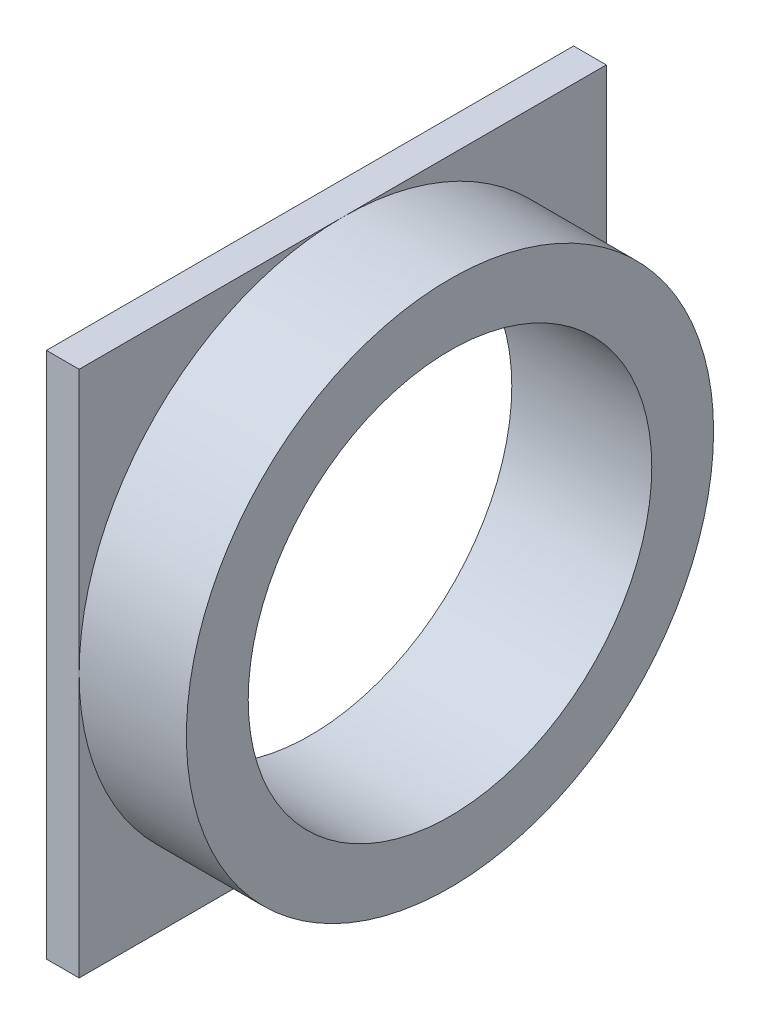
ISO-10303-21;
HEADER;
FILE_DESCRIPTION(('STEP AP214'),'2;1');
FILE_NAME('part.step','',(''),(''),'','','');
FILE_SCHEMA(('AUTOMOTIVE_DESIGN { 1 0 10303 214 1 1 1 1 }'));
ENDSEC;
DATA;
#1=APPLICATION_CONTEXT('core data for automotive mechanical design processes');
#2=APPLICATION_PROTOCOL_DEFINITION('international standard','automotive_design',2000,#1);
#3=PRODUCT_CONTEXT('',#1,'mechanical');
#4=PRODUCT('Part','Part','',(#3));
#5=PRODUCT_RELATED_PRODUCT_CATEGORY('part','',(#4));
#6=PRODUCT_DEFINITION_FORMATION('','',#4);
#7=PRODUCT_DEFINITION_CONTEXT('part definition',#1,'design');
#8=PRODUCT_DEFINITION('design','',#6,#7);
#9=PRODUCT_DEFINITION_SHAPE('','',#8);
#10=(LENGTH_UNIT() NAMED_UNIT(*) SI_UNIT(.MILLI.,.METRE.));
#11=(NAMED_UNIT(*) PLANE_ANGLE_UNIT() SI_UNIT($,.RADIAN.));
#12=(NAMED_UNIT(*) SI_UNIT($,.STERADIAN.) SOLID_ANGLE_UNIT());
#13=UNCERTAINTY_MEASURE_WITH_UNIT(LENGTH_MEASURE(1.E-05),#10,'distance_accuracy_value','');
#14=(GEOMETRIC_REPRESENTATION_CONTEXT(3) GLOBAL_UNCERTAINTY_ASSIGNED_CONTEXT((#13)) GLOBAL_UNIT_ASSIGNED_CONTEXT((#10,
#11,#12)) REPRESENTATION_CONTEXT('',''));
#15=CARTESIAN_POINT('',(0.,0.,0.));
#16=DIRECTION('',(0.,0.,1.));
#17=DIRECTION('',(1.,0.,0.));
#18=AXIS2_PLACEMENT_3D('',#15,#16,#17);
#19=CARTESIAN_POINT('',(7.7,0.,0.));
#20=DIRECTION('',(-1.,0.,0.));
#21=DIRECTION('',(0.,0.,1.));
#22=AXIS2_PLACEMENT_3D('',#19,#20,#21);
#23=CYLINDRICAL_SURFACE('',#22,14.5);
#24=CARTESIAN_POINT('',(7.7,0.,0.));
#25=DIRECTION('',(1.,0.,0.));
#26=DIRECTION('',(0.,0.,-1.));
#27=AXIS2_PLACEMENT_3D('',#24,#25,#26);
#28=CIRCLE('',#27,14.5);
#29=CARTESIAN_POINT('',(7.7,0.,-14.5));
#30=VERTEX_POINT('',#29);
#31=EDGE_CURVE('E113',#30,#30,#28,.T.);
#32=ORIENTED_EDGE('',*,*,#31,.F.);
#33=EDGE_LOOP('',(#32));
#34=FACE_BOUND('',#33,.T.);
#35=CARTESIAN_POINT('',(1.8,0.,0.));
#36=DIRECTION('',(-1.,0.,0.));
#37=DIRECTION('',(0.,0.,1.));
#38=AXIS2_PLACEMENT_3D('',#35,#36,#37);
#39=CIRCLE('',#38,14.5);
#40=CARTESIAN_POINT('',(1.8,0.,14.5));
#41=VERTEX_POINT('',#40);
#42=CARTESIAN_POINT('',(1.8,14.5,0.));
#43=VERTEX_POINT('',#42);
#44=EDGE_CURVE('E11',#41,#43,#39,.T.);
#45=ORIENTED_EDGE('',*,*,#44,.F.);
#46=CARTESIAN_POINT('',(1.8,-14.5,0.));
#47=VERTEX_POINT('',#46);
#48=EDGE_CURVE('E20',#47,#41,#39,.T.);
#49=ORIENTED_EDGE('',*,*,#48,.F.);
#50=CARTESIAN_POINT('',(1.8,0.,-14.5));
#51=VERTEX_POINT('',#50);
#52=EDGE_CURVE('E35',#51,#47,#39,.T.);
#53=ORIENTED_EDGE('',*,*,#52,.F.);
#54=EDGE_CURVE('E25',#43,#51,#39,.T.);
#55=ORIENTED_EDGE('',*,*,#54,.F.);
#56=EDGE_LOOP('',(#45,#49,#53,#55));
#57=FACE_BOUND('',#56,.T.);
#58=ADVANCED_FACE('F17',(#34,#57),#23,.T.);
#59=CARTESIAN_POINT('',(7.7,0.,0.));
#60=DIRECTION('',(1.,0.,0.));
#61=DIRECTION('',(0.,0.,-1.));
#62=AXIS2_PLACEMENT_3D('',#59,#60,#61);
#63=PLANE('',#62);
#64=CARTESIAN_POINT('',(7.7,0.,0.));
#65=DIRECTION('',(1.,0.,0.));
#66=DIRECTION('',(0.,0.,-1.));
#67=AXIS2_PLACEMENT_3D('',#64,#65,#66);
#68=CIRCLE('',#67,11.1);
#69=CARTESIAN_POINT('',(7.7,0.,-11.1));
#70=VERTEX_POINT('',#69);
#71=EDGE_CURVE('E174',#70,#70,#68,.T.);
#72=ORIENTED_EDGE('',*,*,#71,.F.);
#73=EDGE_LOOP('',(#72));
#74=FACE_BOUND('',#73,.T.);
#75=ORIENTED_EDGE('',*,*,#31,.T.);
#76=EDGE_LOOP('',(#75));
#77=FACE_BOUND('',#76,.T.);
#78=ADVANCED_FACE('F138',(#74,#77),#63,.T.);
#79=CARTESIAN_POINT('',(1.8,-14.5,-14.5));
#80=DIRECTION('',(-1.,0.,0.));
#81=DIRECTION('',(0.,0.,1.));
#82=AXIS2_PLACEMENT_3D('',#79,#80,#81);
#83=PLANE('',#82);
#84=DIRECTION('',(0.,1.,0.));
#85=VECTOR('',#84,1.);
#86=CARTESIAN_POINT('',(1.8,14.5,14.5));
#87=LINE('',#86,#85);
#88=CARTESIAN_POINT('',(1.8,14.5,14.5));
#89=VERTEX_POINT('',#88);
#90=EDGE_CURVE('E104',#41,#89,#87,.T.);
#91=ORIENTED_EDGE('',*,*,#90,.F.);
#92=ORIENTED_EDGE('',*,*,#44,.T.);
#93=DIRECTION('',(0.,0.,-1.));
#94=VECTOR('',#93,1.);
#95=CARTESIAN_POINT('',(1.8,14.5,-14.5));
#96=LINE('',#95,#94);
#97=EDGE_CURVE('E89',#89,#43,#96,.T.);
#98=ORIENTED_EDGE('',*,*,#97,.F.);
#99=EDGE_LOOP('',(#91,#92,#98));
#100=FACE_BOUND('',#99,.T.);
#101=ADVANCED_FACE('F136',(#100),#83,.F.);
#102=CARTESIAN_POINT('',(1.8,14.5,-14.5));
#103=VERTEX_POINT('',#102);
#104=EDGE_CURVE('E108',#43,#103,#96,.T.);
#105=ORIENTED_EDGE('',*,*,#104,.F.);
#106=ORIENTED_EDGE('',*,*,#54,.T.);
#107=DIRECTION('',(0.,-1.,0.));
#108=VECTOR('',#107,1.);
#109=CARTESIAN_POINT('',(1.8,14.5,-14.5));
#110=LINE('',#109,#108);
#111=EDGE_CURVE('E99',#103,#51,#110,.T.);
#112=ORIENTED_EDGE('',*,*,#111,.F.);
#113=EDGE_LOOP('',(#105,#106,#112));
#114=FACE_BOUND('',#113,.T.);
#115=ADVANCED_FACE('F129',(#114),#83,.F.);
#116=CARTESIAN_POINT('',(1.8,-14.5,-14.5));
#117=VERTEX_POINT('',#116);
#118=EDGE_CURVE('E84',#51,#117,#110,.T.);
#119=ORIENTED_EDGE('',*,*,#118,.F.);
#120=ORIENTED_EDGE('',*,*,#52,.T.);
#121=DIRECTION('',(0.,0.,1.));
#122=VECTOR('',#121,1.);
#123=CARTESIAN_POINT('',(1.8,-14.5,-14.5));
#124=LINE('',#123,#122);
#125=EDGE_CURVE('E102',#117,#47,#124,.T.);
#126=ORIENTED_EDGE('',*,*,#125,.F.);
#127=EDGE_LOOP('',(#119,#120,#126));
#128=FACE_BOUND('',#127,.T.);
#129=ADVANCED_FACE('F130',(#128),#83,.F.);
#130=CARTESIAN_POINT('',(1.8,-14.5,14.5));
#131=VERTEX_POINT('',#130);
#132=EDGE_CURVE('E101',#47,#131,#124,.T.);
#133=ORIENTED_EDGE('',*,*,#132,.F.);
#134=ORIENTED_EDGE('',*,*,#48,.T.);
#135=EDGE_CURVE('E105',#131,#41,#87,.T.);
#136=ORIENTED_EDGE('',*,*,#135,.F.);
#137=EDGE_LOOP('',(#133,#134,#136));
#138=FACE_BOUND('',#137,.T.);
#139=ADVANCED_FACE('F149',(#138),#83,.F.);
#140=CARTESIAN_POINT('',(1.8,14.5,-14.5));
#141=DIRECTION('',(0.,0.,-1.));
#142=DIRECTION('',(-1.,0.,0.));
#143=AXIS2_PLACEMENT_3D('',#140,#141,#142);
#144=PLANE('',#143);
#145=DIRECTION('',(-1.,0.,0.));
#146=VECTOR('',#145,1.);
#147=CARTESIAN_POINT('',(1.8,-14.5,-14.5));
#148=LINE('',#147,#146);
#149=CARTESIAN_POINT('',(0.,-14.5,-14.5));
#150=VERTEX_POINT('',#149);
#151=EDGE_CURVE('E80',#117,#150,#148,.T.);
#152=ORIENTED_EDGE('',*,*,#151,.T.);
#153=DIRECTION('',(0.,-1.,0.));
#154=VECTOR('',#153,1.);
#155=CARTESIAN_POINT('',(0.,14.5,-14.5));
#156=LINE('',#155,#154);
#157=CARTESIAN_POINT('',(0.,14.5,-14.5));
#158=VERTEX_POINT('',#157);
#159=EDGE_CURVE('E66',#158,#150,#156,.T.);
#160=ORIENTED_EDGE('',*,*,#159,.F.);
#161=DIRECTION('',(-1.,0.,0.));
#162=VECTOR('',#161,1.);
#163=CARTESIAN_POINT('',(1.8,14.5,-14.5));
#164=LINE('',#163,#162);
#165=EDGE_CURVE('E111',#103,#158,#164,.T.);
#166=ORIENTED_EDGE('',*,*,#165,.F.);
#167=ORIENTED_EDGE('',*,*,#111,.T.);
#168=ORIENTED_EDGE('',*,*,#118,.T.);
#169=EDGE_LOOP('',(#152,#160,#166,#167,#168));
#170=FACE_BOUND('',#169,.T.);
#171=ADVANCED_FACE('F81',(#170),#144,.T.);
#172=CARTESIAN_POINT('',(1.8,14.5,-14.5));
#173=DIRECTION('',(0.,1.,0.));
#174=DIRECTION('',(0.,0.,1.));
#175=AXIS2_PLACEMENT_3D('',#172,#173,#174);
#176=PLANE('',#175);
#177=ORIENTED_EDGE('',*,*,#165,.T.);
#178=DIRECTION('',(0.,0.,-1.));
#179=VECTOR('',#178,1.);
#180=CARTESIAN_POINT('',(0.,14.5,-14.5));
#181=LINE('',#180,#179);
#182=CARTESIAN_POINT('',(0.,14.5,14.5));
#183=VERTEX_POINT('',#182);
#184=EDGE_CURVE('E73',#183,#158,#181,.T.);
#185=ORIENTED_EDGE('',*,*,#184,.F.);
#186=DIRECTION('',(-1.,0.,0.));
#187=VECTOR('',#186,1.);
#188=CARTESIAN_POINT('',(1.8,14.5,14.5));
#189=LINE('',#188,#187);
#190=EDGE_CURVE('E114',#89,#183,#189,.T.);
#191=ORIENTED_EDGE('',*,*,#190,.F.);
#192=ORIENTED_EDGE('',*,*,#97,.T.);
#193=ORIENTED_EDGE('',*,*,#104,.T.);
#194=EDGE_LOOP('',(#177,#185,#191,#192,#193));
#195=FACE_BOUND('',#194,.T.);
#196=ADVANCED_FACE('F132',(#195),#176,.T.);
#197=CARTESIAN_POINT('',(1.8,14.5,14.5));
#198=DIRECTION('',(0.,0.,1.));
#199=DIRECTION('',(0.,-1.,0.));
#200=AXIS2_PLACEMENT_3D('',#197,#198,#199);
#201=PLANE('',#200);
#202=DIRECTION('',(0.,1.,0.));
#203=VECTOR('',#202,1.);
#204=CARTESIAN_POINT('',(0.,14.5,14.5));
#205=LINE('',#204,#203);
#206=CARTESIAN_POINT('',(0.,-14.5,14.5));
#207=VERTEX_POINT('',#206);
#208=EDGE_CURVE('E93',#207,#183,#205,.T.);
#209=ORIENTED_EDGE('',*,*,#208,.F.);
#210=DIRECTION('',(-1.,0.,0.));
#211=VECTOR('',#210,1.);
#212=CARTESIAN_POINT('',(1.8,-14.5,14.5));
#213=LINE('',#212,#211);
#214=EDGE_CURVE('E88',#131,#207,#213,.T.);
#215=ORIENTED_EDGE('',*,*,#214,.F.);
#216=ORIENTED_EDGE('',*,*,#135,.T.);
#217=ORIENTED_EDGE('',*,*,#90,.T.);
#218=ORIENTED_EDGE('',*,*,#190,.T.);
#219=EDGE_LOOP('',(#209,#215,#216,#217,#218));
#220=FACE_BOUND('',#219,.T.);
#221=ADVANCED_FACE('F160',(#220),#201,.T.);
#222=CARTESIAN_POINT('',(1.8,-14.5,-14.5));
#223=DIRECTION('',(0.,-1.,0.));
#224=DIRECTION('',(0.,0.,-1.));
#225=AXIS2_PLACEMENT_3D('',#222,#223,#224);
#226=PLANE('',#225);
#227=ORIENTED_EDGE('',*,*,#214,.T.);
#228=DIRECTION('',(0.,0.,1.));
#229=VECTOR('',#228,1.);
#230=CARTESIAN_POINT('',(0.,-14.5,-14.5));
#231=LINE('',#230,#229);
#232=EDGE_CURVE('E70',#150,#207,#231,.T.);
#233=ORIENTED_EDGE('',*,*,#232,.F.);
#234=ORIENTED_EDGE('',*,*,#151,.F.);
#235=ORIENTED_EDGE('',*,*,#125,.T.);
#236=ORIENTED_EDGE('',*,*,#132,.T.);
#237=EDGE_LOOP('',(#227,#233,#234,#235,#236));
#238=FACE_BOUND('',#237,.T.);
#239=ADVANCED_FACE('F91',(#238),#226,.T.);
#240=CARTESIAN_POINT('',(0.,0.,0.));
#241=DIRECTION('',(1.,0.,0.));
#242=DIRECTION('',(0.,0.,-1.));
#243=AXIS2_PLACEMENT_3D('',#240,#241,#242);
#244=PLANE('',#243);
#245=CARTESIAN_POINT('',(0.,0.,0.));
#246=DIRECTION('',(1.,0.,0.));
#247=DIRECTION('',(0.,0.,-1.));
#248=AXIS2_PLACEMENT_3D('',#245,#246,#247);
#249=CIRCLE('',#248,11.1);
#250=CARTESIAN_POINT('',(0.,0.,-11.1));
#251=VERTEX_POINT('',#250);
#252=EDGE_CURVE('E77',#251,#251,#249,.T.);
#253=ORIENTED_EDGE('',*,*,#252,.T.);
#254=EDGE_LOOP('',(#253));
#255=FACE_BOUND('',#254,.T.);
#256=ORIENTED_EDGE('',*,*,#232,.T.);
#257=ORIENTED_EDGE('',*,*,#208,.T.);
#258=ORIENTED_EDGE('',*,*,#184,.T.);
#259=ORIENTED_EDGE('',*,*,#159,.T.);
#260=EDGE_LOOP('',(#256,#257,#258,#259));
#261=FACE_BOUND('',#260,.T.);
#262=ADVANCED_FACE('F68',(#255,#261),#244,.F.);
#263=CARTESIAN_POINT('',(0.,0.,0.));
#264=DIRECTION('',(1.,0.,0.));
#265=DIRECTION('',(0.,0.,-1.));
#266=AXIS2_PLACEMENT_3D('',#263,#264,#265);
#267=CYLINDRICAL_SURFACE('',#266,11.1);
#268=ORIENTED_EDGE('',*,*,#252,.F.);
#269=EDGE_LOOP('',(#268));
#270=FACE_BOUND('',#269,.T.);
#271=ORIENTED_EDGE('',*,*,#71,.T.);
#272=EDGE_LOOP('',(#271));
#273=FACE_BOUND('',#272,.T.);
#274=ADVANCED_FACE('F154',(#270,#273),#267,.F.);
#275=CLOSED_SHELL('',(#58,#78,#101,#115,#129,#139,#171,#196,#221,#239,#262,#274));
#276=MANIFOLD_SOLID_BREP('B1',#275);
#277=ADVANCED_BREP_SHAPE_REPRESENTATION('',(#18,#276),#14);
#278=SHAPE_DEFINITION_REPRESENTATION(#9,#277);
ENDSEC;
END-ISO-10303-21;
